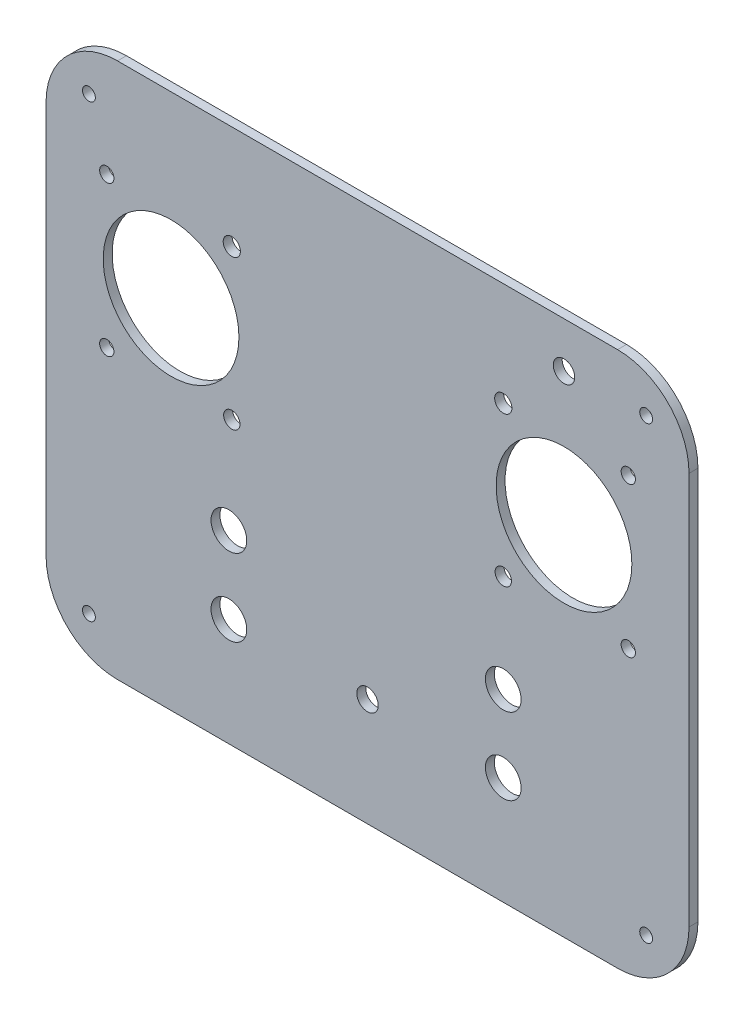
ISO-10303-21;
HEADER;
FILE_DESCRIPTION(('STEP AP214'),'2;1');
FILE_NAME('part.step','',(''),(''),'','','');
FILE_SCHEMA(('AUTOMOTIVE_DESIGN { 1 0 10303 214 1 1 1 1 }'));
ENDSEC;
DATA;
#1=APPLICATION_CONTEXT('core data for automotive mechanical design processes');
#2=APPLICATION_PROTOCOL_DEFINITION('international standard','automotive_design',2000,#1);
#3=PRODUCT_CONTEXT('',#1,'mechanical');
#4=PRODUCT('Part','Part','',(#3));
#5=PRODUCT_RELATED_PRODUCT_CATEGORY('part','',(#4));
#6=PRODUCT_DEFINITION_FORMATION('','',#4);
#7=PRODUCT_DEFINITION_CONTEXT('part definition',#1,'design');
#8=PRODUCT_DEFINITION('design','',#6,#7);
#9=PRODUCT_DEFINITION_SHAPE('','',#8);
#10=(LENGTH_UNIT() NAMED_UNIT(*) SI_UNIT(.MILLI.,.METRE.));
#11=(NAMED_UNIT(*) PLANE_ANGLE_UNIT() SI_UNIT($,.RADIAN.));
#12=(NAMED_UNIT(*) SI_UNIT($,.STERADIAN.) SOLID_ANGLE_UNIT());
#13=UNCERTAINTY_MEASURE_WITH_UNIT(LENGTH_MEASURE(1.E-05),#10,'distance_accuracy_value','');
#14=(GEOMETRIC_REPRESENTATION_CONTEXT(3) GLOBAL_UNCERTAINTY_ASSIGNED_CONTEXT((#13)) GLOBAL_UNIT_ASSIGNED_CONTEXT((#10,
#11,#12)) REPRESENTATION_CONTEXT('',''));
#15=CARTESIAN_POINT('',(0.,0.,0.));
#16=DIRECTION('',(0.,0.,1.));
#17=DIRECTION('',(1.,0.,0.));
#18=AXIS2_PLACEMENT_3D('',#15,#16,#17);
#19=CARTESIAN_POINT('',(0.,0.,2.5));
#20=DIRECTION('',(0.,0.,1.));
#21=DIRECTION('',(1.,0.,0.));
#22=AXIS2_PLACEMENT_3D('',#19,#20,#21);
#23=PLANE('',#22);
#24=CARTESIAN_POINT('',(79.0188679245283,-45.3962264150944,2.5));
#25=DIRECTION('',(0.,0.,-1.));
#26=DIRECTION('',(-1.,0.,0.));
#27=AXIS2_PLACEMENT_3D('',#24,#25,#26);
#28=CIRCLE('',#27,1.79999999999999);
#29=CARTESIAN_POINT('',(77.2188679245283,-45.3962264150944,2.5));
#30=VERTEX_POINT('',#29);
#31=EDGE_CURVE('E596',#30,#30,#28,.T.);
#32=ORIENTED_EDGE('',*,*,#31,.T.);
#33=EDGE_LOOP('',(#32));
#34=FACE_BOUND('',#33,.T.);
#35=CARTESIAN_POINT('',(79.0188679245282,80.6037735849056,2.5));
#36=DIRECTION('',(0.,0.,1.));
#37=DIRECTION('',(1.,0.,0.));
#38=AXIS2_PLACEMENT_3D('',#35,#36,#37);
#39=CIRCLE('',#38,1.79999999999999);
#40=CARTESIAN_POINT('',(80.8188679245282,80.6037735849056,2.5));
#41=VERTEX_POINT('',#40);
#42=EDGE_CURVE('E587',#41,#41,#39,.T.);
#43=ORIENTED_EDGE('',*,*,#42,.F.);
#44=EDGE_LOOP('',(#43));
#45=FACE_BOUND('',#44,.T.);
#46=CARTESIAN_POINT('',(56.0188679245283,79.8768607493267,2.5));
#47=DIRECTION('',(0.,0.,1.));
#48=DIRECTION('',(1.,0.,0.));
#49=AXIS2_PLACEMENT_3D('',#46,#47,#48);
#50=CIRCLE('',#49,3.);
#51=CARTESIAN_POINT('',(59.0188679245283,79.8768607493267,2.5));
#52=VERTEX_POINT('',#51);
#53=EDGE_CURVE('E168',#52,#52,#50,.T.);
#54=ORIENTED_EDGE('',*,*,#53,.F.);
#55=EDGE_LOOP('',(#54));
#56=FACE_BOUND('',#55,.T.);
#57=CARTESIAN_POINT('',(39.0188679245283,-27.2070166596847,2.5));
#58=DIRECTION('',(0.,0.,1.));
#59=DIRECTION('',(1.,0.,0.));
#60=AXIS2_PLACEMENT_3D('',#57,#58,#59);
#61=CIRCLE('',#60,5.);
#62=CARTESIAN_POINT('',(44.0188679245283,-27.2070166596847,2.5));
#63=VERTEX_POINT('',#62);
#64=EDGE_CURVE('E269',#63,#63,#61,.T.);
#65=ORIENTED_EDGE('',*,*,#64,.F.);
#66=EDGE_LOOP('',(#65));
#67=FACE_BOUND('',#66,.T.);
#68=CARTESIAN_POINT('',(1.01886792452827,-27.2070166596847,2.5));
#69=DIRECTION('',(0.,0.,1.));
#70=DIRECTION('',(1.,0.,0.));
#71=AXIS2_PLACEMENT_3D('',#68,#69,#70);
#72=CIRCLE('',#71,3.);
#73=CARTESIAN_POINT('',(4.01886792452827,-27.2070166596847,2.5));
#74=VERTEX_POINT('',#73);
#75=EDGE_CURVE('E265',#74,#74,#72,.T.);
#76=ORIENTED_EDGE('',*,*,#75,.F.);
#77=EDGE_LOOP('',(#76));
#78=FACE_BOUND('',#77,.T.);
#79=CARTESIAN_POINT('',(39.0188679245283,-5.76046776144588,2.5));
#80=DIRECTION('',(0.,0.,1.));
#81=DIRECTION('',(1.,0.,0.));
#82=AXIS2_PLACEMENT_3D('',#79,#80,#81);
#83=CIRCLE('',#82,5.);
#84=CARTESIAN_POINT('',(44.0188679245283,-5.76046776144588,2.5));
#85=VERTEX_POINT('',#84);
#86=EDGE_CURVE('E261',#85,#85,#83,.T.);
#87=ORIENTED_EDGE('',*,*,#86,.F.);
#88=EDGE_LOOP('',(#87));
#89=FACE_BOUND('',#88,.T.);
#90=CARTESIAN_POINT('',(-37.7979617415857,-5.63757231501688,2.5));
#91=DIRECTION('',(0.,0.,1.));
#92=DIRECTION('',(1.,0.,0.));
#93=AXIS2_PLACEMENT_3D('',#90,#91,#92);
#94=CIRCLE('',#93,5.);
#95=CARTESIAN_POINT('',(-32.7979617415857,-5.63757231501688,2.5));
#96=VERTEX_POINT('',#95);
#97=EDGE_CURVE('E257',#96,#96,#94,.T.);
#98=ORIENTED_EDGE('',*,*,#97,.F.);
#99=EDGE_LOOP('',(#98));
#100=FACE_BOUND('',#99,.T.);
#101=CARTESIAN_POINT('',(-37.7979617415857,-27.2070166596847,2.5));
#102=DIRECTION('',(0.,0.,1.));
#103=DIRECTION('',(1.,0.,0.));
#104=AXIS2_PLACEMENT_3D('',#101,#102,#103);
#105=CIRCLE('',#104,5.);
#106=CARTESIAN_POINT('',(-32.7979617415857,-27.2070166596847,2.5));
#107=VERTEX_POINT('',#106);
#108=EDGE_CURVE('E253',#107,#107,#105,.T.);
#109=ORIENTED_EDGE('',*,*,#108,.F.);
#110=EDGE_LOOP('',(#109));
#111=FACE_BOUND('',#110,.T.);
#112=CARTESIAN_POINT('',(39.0188679245283,21.6037735849056,2.5));
#113=DIRECTION('',(0.,0.,1.));
#114=DIRECTION('',(1.,0.,0.));
#115=AXIS2_PLACEMENT_3D('',#112,#113,#114);
#116=CIRCLE('',#115,2.29012975988847);
#117=CARTESIAN_POINT('',(41.3089976844167,21.6037735849056,2.5));
#118=VERTEX_POINT('',#117);
#119=EDGE_CURVE('E249',#118,#118,#116,.F.);
#120=ORIENTED_EDGE('',*,*,#119,.T.);
#121=EDGE_LOOP('',(#120));
#122=FACE_BOUND('',#121,.T.);
#123=CARTESIAN_POINT('',(74.0188679245283,21.6037735849056,2.5));
#124=DIRECTION('',(0.,0.,1.));
#125=DIRECTION('',(1.,0.,0.));
#126=AXIS2_PLACEMENT_3D('',#123,#124,#125);
#127=CIRCLE('',#126,2.);
#128=CARTESIAN_POINT('',(76.0188679245283,21.6037735849056,2.5));
#129=VERTEX_POINT('',#128);
#130=EDGE_CURVE('E245',#129,#129,#127,.T.);
#131=ORIENTED_EDGE('',*,*,#130,.F.);
#132=EDGE_LOOP('',(#131));
#133=FACE_BOUND('',#132,.T.);
#134=CARTESIAN_POINT('',(39.0188679245283,63.6037735849056,2.5));
#135=DIRECTION('',(0.,0.,1.));
#136=DIRECTION('',(1.,0.,0.));
#137=AXIS2_PLACEMENT_3D('',#134,#135,#136);
#138=CIRCLE('',#137,2.41222754524556);
#139=CARTESIAN_POINT('',(41.4310954697738,63.6037735849056,2.5));
#140=VERTEX_POINT('',#139);
#141=EDGE_CURVE('E241',#140,#140,#138,.F.);
#142=ORIENTED_EDGE('',*,*,#141,.T.);
#143=EDGE_LOOP('',(#142));
#144=FACE_BOUND('',#143,.T.);
#145=CARTESIAN_POINT('',(-36.9811320754717,21.6037735849056,2.5));
#146=DIRECTION('',(0.,0.,1.));
#147=DIRECTION('',(1.,0.,0.));
#148=AXIS2_PLACEMENT_3D('',#145,#146,#147);
#149=CIRCLE('',#148,2.29012975988847);
#150=CARTESIAN_POINT('',(-34.6910023155833,21.6037735849056,2.5));
#151=VERTEX_POINT('',#150);
#152=EDGE_CURVE('E237',#151,#151,#149,.T.);
#153=ORIENTED_EDGE('',*,*,#152,.F.);
#154=EDGE_LOOP('',(#153));
#155=FACE_BOUND('',#154,.T.);
#156=CARTESIAN_POINT('',(-36.9811320754717,63.6037735849056,2.5));
#157=DIRECTION('',(0.,0.,1.));
#158=DIRECTION('',(1.,0.,0.));
#159=AXIS2_PLACEMENT_3D('',#156,#157,#158);
#160=CIRCLE('',#159,2.41222754524556);
#161=CARTESIAN_POINT('',(-34.5689045302262,63.6037735849056,2.5));
#162=VERTEX_POINT('',#161);
#163=EDGE_CURVE('E233',#162,#162,#160,.T.);
#164=ORIENTED_EDGE('',*,*,#163,.F.);
#165=EDGE_LOOP('',(#164));
#166=FACE_BOUND('',#165,.T.);
#167=DIRECTION('',(1.,0.,0.));
#168=VECTOR('',#167,1.);
#169=CARTESIAN_POINT('',(0.,92.6037735849056,2.5));
#170=LINE('',#169,#168);
#171=CARTESIAN_POINT('',(-68.9811320754717,92.6037735849056,2.5));
#172=VERTEX_POINT('',#171);
#173=CARTESIAN_POINT('',(71.0188679245283,92.6037735849056,2.5));
#174=VERTEX_POINT('',#173);
#175=EDGE_CURVE('E225',#172,#174,#170,.T.);
#176=ORIENTED_EDGE('',*,*,#175,.F.);
#177=CARTESIAN_POINT('',(-68.9811320754717,72.6037735849056,2.5));
#178=DIRECTION('',(0.,0.,1.));
#179=DIRECTION('',(1.,0.,0.));
#180=AXIS2_PLACEMENT_3D('',#177,#178,#179);
#181=CIRCLE('',#180,20.);
#182=CARTESIAN_POINT('',(-88.9811320754717,72.6037735849056,2.5));
#183=VERTEX_POINT('',#182);
#184=EDGE_CURVE('E191',#172,#183,#181,.T.);
#185=ORIENTED_EDGE('',*,*,#184,.T.);
#186=DIRECTION('',(0.,-1.,0.));
#187=VECTOR('',#186,1.);
#188=CARTESIAN_POINT('',(-88.9811320754717,0.,2.5));
#189=LINE('',#188,#187);
#190=CARTESIAN_POINT('',(-88.9811320754717,-37.3962264150944,2.5));
#191=VERTEX_POINT('',#190);
#192=EDGE_CURVE('E128',#183,#191,#189,.T.);
#193=ORIENTED_EDGE('',*,*,#192,.T.);
#194=CARTESIAN_POINT('',(-68.9811320754717,-37.3962264150944,2.5));
#195=DIRECTION('',(0.,0.,1.));
#196=DIRECTION('',(1.,0.,0.));
#197=AXIS2_PLACEMENT_3D('',#194,#195,#196);
#198=CIRCLE('',#197,20.);
#199=CARTESIAN_POINT('',(-68.9811320754717,-57.3962264150944,2.5));
#200=VERTEX_POINT('',#199);
#201=EDGE_CURVE('E63',#191,#200,#198,.T.);
#202=ORIENTED_EDGE('',*,*,#201,.T.);
#203=DIRECTION('',(1.,0.,0.));
#204=VECTOR('',#203,1.);
#205=CARTESIAN_POINT('',(0.,-57.3962264150944,2.5));
#206=LINE('',#205,#204);
#207=CARTESIAN_POINT('',(71.0188679245283,-57.3962264150944,2.5));
#208=VERTEX_POINT('',#207);
#209=EDGE_CURVE('E220',#200,#208,#206,.T.);
#210=ORIENTED_EDGE('',*,*,#209,.T.);
#211=CARTESIAN_POINT('',(71.0188679245283,-37.3962264150944,2.5));
#212=DIRECTION('',(0.,0.,1.));
#213=DIRECTION('',(1.,0.,0.));
#214=AXIS2_PLACEMENT_3D('',#211,#212,#213);
#215=CIRCLE('',#214,20.);
#216=CARTESIAN_POINT('',(91.0188679245283,-37.3962264150944,2.5));
#217=VERTEX_POINT('',#216);
#218=EDGE_CURVE('E183',#208,#217,#215,.T.);
#219=ORIENTED_EDGE('',*,*,#218,.T.);
#220=DIRECTION('',(0.,-1.,0.));
#221=VECTOR('',#220,1.);
#222=CARTESIAN_POINT('',(91.0188679245283,0.,2.5));
#223=LINE('',#222,#221);
#224=CARTESIAN_POINT('',(91.0188679245283,72.6037735849056,2.5));
#225=VERTEX_POINT('',#224);
#226=EDGE_CURVE('E229',#225,#217,#223,.T.);
#227=ORIENTED_EDGE('',*,*,#226,.F.);
#228=CARTESIAN_POINT('',(71.0188679245283,72.6037735849056,2.5));
#229=DIRECTION('',(0.,0.,1.));
#230=DIRECTION('',(1.,0.,0.));
#231=AXIS2_PLACEMENT_3D('',#228,#229,#230);
#232=CIRCLE('',#231,20.);
#233=EDGE_CURVE('E188',#225,#174,#232,.T.);
#234=ORIENTED_EDGE('',*,*,#233,.T.);
#235=EDGE_LOOP('',(#176,#185,#193,#202,#210,#219,#227,#234));
#236=FACE_BOUND('',#235,.T.);
#237=CARTESIAN_POINT('',(-53.9811320754717,42.6037735849056,2.5));
#238=DIRECTION('',(0.,0.,1.));
#239=DIRECTION('',(1.,0.,0.));
#240=AXIS2_PLACEMENT_3D('',#237,#238,#239);
#241=CIRCLE('',#240,19.);
#242=CARTESIAN_POINT('',(-34.9811320754717,42.6037735849056,2.5));
#243=VERTEX_POINT('',#242);
#244=EDGE_CURVE('E216',#243,#243,#241,.T.);
#245=ORIENTED_EDGE('',*,*,#244,.F.);
#246=EDGE_LOOP('',(#245));
#247=FACE_BOUND('',#246,.T.);
#248=CARTESIAN_POINT('',(-71.9811320754717,63.6037735849056,2.5));
#249=DIRECTION('',(0.,0.,1.));
#250=DIRECTION('',(1.,0.,0.));
#251=AXIS2_PLACEMENT_3D('',#248,#249,#250);
#252=CIRCLE('',#251,2.);
#253=CARTESIAN_POINT('',(-69.9811320754717,63.6037735849056,2.5));
#254=VERTEX_POINT('',#253);
#255=EDGE_CURVE('E212',#254,#254,#252,.T.);
#256=ORIENTED_EDGE('',*,*,#255,.F.);
#257=EDGE_LOOP('',(#256));
#258=FACE_BOUND('',#257,.T.);
#259=CARTESIAN_POINT('',(-71.9811320754717,21.6037735849056,2.5));
#260=DIRECTION('',(0.,0.,1.));
#261=DIRECTION('',(1.,0.,0.));
#262=AXIS2_PLACEMENT_3D('',#259,#260,#261);
#263=CIRCLE('',#262,2.);
#264=CARTESIAN_POINT('',(-69.9811320754717,21.6037735849056,2.5));
#265=VERTEX_POINT('',#264);
#266=EDGE_CURVE('E208',#265,#265,#263,.F.);
#267=ORIENTED_EDGE('',*,*,#266,.T.);
#268=EDGE_LOOP('',(#267));
#269=FACE_BOUND('',#268,.T.);
#270=CARTESIAN_POINT('',(74.0188679245283,63.6037735849056,2.5));
#271=DIRECTION('',(0.,0.,1.));
#272=DIRECTION('',(1.,0.,0.));
#273=AXIS2_PLACEMENT_3D('',#270,#271,#272);
#274=CIRCLE('',#273,2.);
#275=CARTESIAN_POINT('',(76.0188679245283,63.6037735849056,2.5));
#276=VERTEX_POINT('',#275);
#277=EDGE_CURVE('E204',#276,#276,#274,.F.);
#278=ORIENTED_EDGE('',*,*,#277,.T.);
#279=EDGE_LOOP('',(#278));
#280=FACE_BOUND('',#279,.T.);
#281=CARTESIAN_POINT('',(56.0188679245283,42.6037735849056,2.5));
#282=DIRECTION('',(0.,0.,1.));
#283=DIRECTION('',(1.,0.,0.));
#284=AXIS2_PLACEMENT_3D('',#281,#282,#283);
#285=CIRCLE('',#284,19.);
#286=CARTESIAN_POINT('',(75.0188679245283,42.6037735849056,2.5));
#287=VERTEX_POINT('',#286);
#288=EDGE_CURVE('E170',#287,#287,#285,.F.);
#289=ORIENTED_EDGE('',*,*,#288,.T.);
#290=EDGE_LOOP('',(#289));
#291=FACE_BOUND('',#290,.T.);
#292=CARTESIAN_POINT('',(-76.9811320754717,-45.3962264150944,2.5));
#293=DIRECTION('',(0.,0.,1.));
#294=DIRECTION('',(1.,0.,0.));
#295=AXIS2_PLACEMENT_3D('',#292,#293,#294);
#296=CIRCLE('',#295,1.79999999999999);
#297=CARTESIAN_POINT('',(-75.1811320754717,-45.3962264150944,2.5));
#298=VERTEX_POINT('',#297);
#299=EDGE_CURVE('E583',#298,#298,#296,.T.);
#300=ORIENTED_EDGE('',*,*,#299,.F.);
#301=EDGE_LOOP('',(#300));
#302=FACE_BOUND('',#301,.T.);
#303=CARTESIAN_POINT('',(-76.9811320754717,80.6037735849056,2.5));
#304=DIRECTION('',(0.,0.,-1.));
#305=DIRECTION('',(-1.,0.,0.));
#306=AXIS2_PLACEMENT_3D('',#303,#304,#305);
#307=CIRCLE('',#306,1.80000000000001);
#308=CARTESIAN_POINT('',(-78.7811320754717,80.6037735849056,2.5));
#309=VERTEX_POINT('',#308);
#310=EDGE_CURVE('E572',#309,#309,#307,.T.);
#311=ORIENTED_EDGE('',*,*,#310,.T.);
#312=EDGE_LOOP('',(#311));
#313=FACE_BOUND('',#312,.T.);
#314=ADVANCED_FACE('F41',(#34,#45,#56,#67,#78,#89,#100,#111,#122,#133,#144,#155,#166,#236,#247,
#258,#269,#280,#291,#302,#313),#23,.T.);
#315=CARTESIAN_POINT('',(0.,0.,0.));
#316=DIRECTION('',(0.,0.,1.));
#317=DIRECTION('',(1.,0.,0.));
#318=AXIS2_PLACEMENT_3D('',#315,#316,#317);
#319=PLANE('',#318);
#320=CARTESIAN_POINT('',(-76.9811320754717,-45.3962264150944,0.));
#321=DIRECTION('',(0.,0.,1.));
#322=DIRECTION('',(1.,0.,0.));
#323=AXIS2_PLACEMENT_3D('',#320,#321,#322);
#324=CIRCLE('',#323,1.79999999999999);
#325=CARTESIAN_POINT('',(-75.1811320754717,-45.3962264150944,0.));
#326=VERTEX_POINT('',#325);
#327=EDGE_CURVE('E578',#326,#326,#324,.F.);
#328=ORIENTED_EDGE('',*,*,#327,.F.);
#329=EDGE_LOOP('',(#328));
#330=FACE_BOUND('',#329,.T.);
#331=CARTESIAN_POINT('',(79.0188679245282,80.6037735849056,0.));
#332=DIRECTION('',(0.,0.,1.));
#333=DIRECTION('',(1.,0.,0.));
#334=AXIS2_PLACEMENT_3D('',#331,#332,#333);
#335=CIRCLE('',#334,1.79999999999999);
#336=CARTESIAN_POINT('',(80.8188679245282,80.6037735849056,0.));
#337=VERTEX_POINT('',#336);
#338=EDGE_CURVE('E279',#337,#337,#335,.F.);
#339=ORIENTED_EDGE('',*,*,#338,.F.);
#340=EDGE_LOOP('',(#339));
#341=FACE_BOUND('',#340,.T.);
#342=CARTESIAN_POINT('',(56.0188679245283,79.8768607493267,0.));
#343=DIRECTION('',(0.,0.,1.));
#344=DIRECTION('',(1.,0.,0.));
#345=AXIS2_PLACEMENT_3D('',#342,#343,#344);
#346=CIRCLE('',#345,3.);
#347=CARTESIAN_POINT('',(59.0188679245283,79.8768607493267,0.));
#348=VERTEX_POINT('',#347);
#349=EDGE_CURVE('E282',#348,#348,#346,.T.);
#350=ORIENTED_EDGE('',*,*,#349,.T.);
#351=EDGE_LOOP('',(#350));
#352=FACE_BOUND('',#351,.T.);
#353=CARTESIAN_POINT('',(39.0188679245283,-27.2070166596847,0.));
#354=DIRECTION('',(0.,0.,1.));
#355=DIRECTION('',(1.,0.,0.));
#356=AXIS2_PLACEMENT_3D('',#353,#354,#355);
#357=CIRCLE('',#356,5.);
#358=CARTESIAN_POINT('',(44.0188679245283,-27.2070166596847,0.));
#359=VERTEX_POINT('',#358);
#360=EDGE_CURVE('E286',#359,#359,#357,.T.);
#361=ORIENTED_EDGE('',*,*,#360,.T.);
#362=EDGE_LOOP('',(#361));
#363=FACE_BOUND('',#362,.T.);
#364=CARTESIAN_POINT('',(1.01886792452827,-27.2070166596847,0.));
#365=DIRECTION('',(0.,0.,1.));
#366=DIRECTION('',(1.,0.,0.));
#367=AXIS2_PLACEMENT_3D('',#364,#365,#366);
#368=CIRCLE('',#367,3.);
#369=CARTESIAN_POINT('',(4.01886792452827,-27.2070166596847,0.));
#370=VERTEX_POINT('',#369);
#371=EDGE_CURVE('E290',#370,#370,#368,.T.);
#372=ORIENTED_EDGE('',*,*,#371,.T.);
#373=EDGE_LOOP('',(#372));
#374=FACE_BOUND('',#373,.T.);
#375=CARTESIAN_POINT('',(39.0188679245283,-5.76046776144588,0.));
#376=DIRECTION('',(0.,0.,1.));
#377=DIRECTION('',(1.,0.,0.));
#378=AXIS2_PLACEMENT_3D('',#375,#376,#377);
#379=CIRCLE('',#378,5.);
#380=CARTESIAN_POINT('',(44.0188679245283,-5.76046776144588,0.));
#381=VERTEX_POINT('',#380);
#382=EDGE_CURVE('E294',#381,#381,#379,.T.);
#383=ORIENTED_EDGE('',*,*,#382,.T.);
#384=EDGE_LOOP('',(#383));
#385=FACE_BOUND('',#384,.T.);
#386=CARTESIAN_POINT('',(-37.7979617415857,-5.63757231501688,0.));
#387=DIRECTION('',(0.,0.,1.));
#388=DIRECTION('',(1.,0.,0.));
#389=AXIS2_PLACEMENT_3D('',#386,#387,#388);
#390=CIRCLE('',#389,5.);
#391=CARTESIAN_POINT('',(-32.7979617415857,-5.63757231501688,0.));
#392=VERTEX_POINT('',#391);
#393=EDGE_CURVE('E298',#392,#392,#390,.T.);
#394=ORIENTED_EDGE('',*,*,#393,.T.);
#395=EDGE_LOOP('',(#394));
#396=FACE_BOUND('',#395,.T.);
#397=CARTESIAN_POINT('',(-37.7979617415857,-27.2070166596847,0.));
#398=DIRECTION('',(0.,0.,1.));
#399=DIRECTION('',(1.,0.,0.));
#400=AXIS2_PLACEMENT_3D('',#397,#398,#399);
#401=CIRCLE('',#400,5.);
#402=CARTESIAN_POINT('',(-32.7979617415857,-27.2070166596847,0.));
#403=VERTEX_POINT('',#402);
#404=EDGE_CURVE('E302',#403,#403,#401,.T.);
#405=ORIENTED_EDGE('',*,*,#404,.T.);
#406=EDGE_LOOP('',(#405));
#407=FACE_BOUND('',#406,.T.);
#408=CARTESIAN_POINT('',(39.0188679245283,21.6037735849056,0.));
#409=DIRECTION('',(0.,0.,1.));
#410=DIRECTION('',(1.,0.,0.));
#411=AXIS2_PLACEMENT_3D('',#408,#409,#410);
#412=CIRCLE('',#411,2.29012975988847);
#413=CARTESIAN_POINT('',(41.3089976844167,21.6037735849056,0.));
#414=VERTEX_POINT('',#413);
#415=EDGE_CURVE('E306',#414,#414,#412,.F.);
#416=ORIENTED_EDGE('',*,*,#415,.F.);
#417=EDGE_LOOP('',(#416));
#418=FACE_BOUND('',#417,.T.);
#419=CARTESIAN_POINT('',(74.0188679245283,21.6037735849056,0.));
#420=DIRECTION('',(0.,0.,1.));
#421=DIRECTION('',(1.,0.,0.));
#422=AXIS2_PLACEMENT_3D('',#419,#420,#421);
#423=CIRCLE('',#422,2.);
#424=CARTESIAN_POINT('',(76.0188679245283,21.6037735849056,0.));
#425=VERTEX_POINT('',#424);
#426=EDGE_CURVE('E310',#425,#425,#423,.T.);
#427=ORIENTED_EDGE('',*,*,#426,.T.);
#428=EDGE_LOOP('',(#427));
#429=FACE_BOUND('',#428,.T.);
#430=CARTESIAN_POINT('',(39.0188679245283,63.6037735849056,0.));
#431=DIRECTION('',(0.,0.,1.));
#432=DIRECTION('',(1.,0.,0.));
#433=AXIS2_PLACEMENT_3D('',#430,#431,#432);
#434=CIRCLE('',#433,2.41222754524556);
#435=CARTESIAN_POINT('',(41.4310954697738,63.6037735849056,0.));
#436=VERTEX_POINT('',#435);
#437=EDGE_CURVE('E314',#436,#436,#434,.F.);
#438=ORIENTED_EDGE('',*,*,#437,.F.);
#439=EDGE_LOOP('',(#438));
#440=FACE_BOUND('',#439,.T.);
#441=CARTESIAN_POINT('',(-36.9811320754717,21.6037735849056,0.));
#442=DIRECTION('',(0.,0.,1.));
#443=DIRECTION('',(1.,0.,0.));
#444=AXIS2_PLACEMENT_3D('',#441,#442,#443);
#445=CIRCLE('',#444,2.29012975988847);
#446=CARTESIAN_POINT('',(-34.6910023155833,21.6037735849056,0.));
#447=VERTEX_POINT('',#446);
#448=EDGE_CURVE('E318',#447,#447,#445,.T.);
#449=ORIENTED_EDGE('',*,*,#448,.T.);
#450=EDGE_LOOP('',(#449));
#451=FACE_BOUND('',#450,.T.);
#452=CARTESIAN_POINT('',(-36.9811320754717,63.6037735849056,0.));
#453=DIRECTION('',(0.,0.,1.));
#454=DIRECTION('',(1.,0.,0.));
#455=AXIS2_PLACEMENT_3D('',#452,#453,#454);
#456=CIRCLE('',#455,2.41222754524556);
#457=CARTESIAN_POINT('',(-34.5689045302262,63.6037735849056,0.));
#458=VERTEX_POINT('',#457);
#459=EDGE_CURVE('E322',#458,#458,#456,.T.);
#460=ORIENTED_EDGE('',*,*,#459,.T.);
#461=EDGE_LOOP('',(#460));
#462=FACE_BOUND('',#461,.T.);
#463=DIRECTION('',(0.,-1.,0.));
#464=VECTOR('',#463,1.);
#465=CARTESIAN_POINT('',(-88.9811320754717,0.,0.));
#466=LINE('',#465,#464);
#467=CARTESIAN_POINT('',(-88.9811320754717,72.6037735849056,0.));
#468=VERTEX_POINT('',#467);
#469=CARTESIAN_POINT('',(-88.9811320754717,-37.3962264150944,0.));
#470=VERTEX_POINT('',#469);
#471=EDGE_CURVE('E126',#468,#470,#466,.T.);
#472=ORIENTED_EDGE('',*,*,#471,.F.);
#473=CARTESIAN_POINT('',(-68.9811320754717,72.6037735849056,0.));
#474=DIRECTION('',(0.,0.,1.));
#475=DIRECTION('',(1.,0.,0.));
#476=AXIS2_PLACEMENT_3D('',#473,#474,#475);
#477=CIRCLE('',#476,20.);
#478=CARTESIAN_POINT('',(-68.9811320754717,92.6037735849056,0.));
#479=VERTEX_POINT('',#478);
#480=EDGE_CURVE('E108',#468,#479,#477,.F.);
#481=ORIENTED_EDGE('',*,*,#480,.T.);
#482=DIRECTION('',(1.,0.,0.));
#483=VECTOR('',#482,1.);
#484=CARTESIAN_POINT('',(0.,92.6037735849056,0.));
#485=LINE('',#484,#483);
#486=CARTESIAN_POINT('',(71.0188679245283,92.6037735849056,0.));
#487=VERTEX_POINT('',#486);
#488=EDGE_CURVE('E139',#479,#487,#485,.T.);
#489=ORIENTED_EDGE('',*,*,#488,.T.);
#490=CARTESIAN_POINT('',(71.0188679245283,72.6037735849056,0.));
#491=DIRECTION('',(0.,0.,1.));
#492=DIRECTION('',(1.,0.,0.));
#493=AXIS2_PLACEMENT_3D('',#490,#491,#492);
#494=CIRCLE('',#493,20.);
#495=CARTESIAN_POINT('',(91.0188679245283,72.6037735849056,0.));
#496=VERTEX_POINT('',#495);
#497=EDGE_CURVE('E120',#487,#496,#494,.F.);
#498=ORIENTED_EDGE('',*,*,#497,.T.);
#499=DIRECTION('',(0.,-1.,0.));
#500=VECTOR('',#499,1.);
#501=CARTESIAN_POINT('',(91.0188679245283,0.,0.));
#502=LINE('',#501,#500);
#503=CARTESIAN_POINT('',(91.0188679245283,-37.3962264150944,0.));
#504=VERTEX_POINT('',#503);
#505=EDGE_CURVE('E145',#496,#504,#502,.T.);
#506=ORIENTED_EDGE('',*,*,#505,.T.);
#507=CARTESIAN_POINT('',(71.0188679245283,-37.3962264150944,0.));
#508=DIRECTION('',(0.,0.,1.));
#509=DIRECTION('',(1.,0.,0.));
#510=AXIS2_PLACEMENT_3D('',#507,#508,#509);
#511=CIRCLE('',#510,20.);
#512=CARTESIAN_POINT('',(71.0188679245283,-57.3962264150944,0.));
#513=VERTEX_POINT('',#512);
#514=EDGE_CURVE('E130',#504,#513,#511,.F.);
#515=ORIENTED_EDGE('',*,*,#514,.T.);
#516=DIRECTION('',(1.,0.,0.));
#517=VECTOR('',#516,1.);
#518=CARTESIAN_POINT('',(0.,-57.3962264150944,0.));
#519=LINE('',#518,#517);
#520=CARTESIAN_POINT('',(-68.9811320754717,-57.3962264150944,0.));
#521=VERTEX_POINT('',#520);
#522=EDGE_CURVE('E138',#521,#513,#519,.T.);
#523=ORIENTED_EDGE('',*,*,#522,.F.);
#524=CARTESIAN_POINT('',(-68.9811320754717,-37.3962264150944,0.));
#525=DIRECTION('',(0.,0.,1.));
#526=DIRECTION('',(1.,0.,0.));
#527=AXIS2_PLACEMENT_3D('',#524,#525,#526);
#528=CIRCLE('',#527,20.);
#529=EDGE_CURVE('E136',#521,#470,#528,.F.);
#530=ORIENTED_EDGE('',*,*,#529,.T.);
#531=EDGE_LOOP('',(#472,#481,#489,#498,#506,#515,#523,#530));
#532=FACE_BOUND('',#531,.T.);
#533=CARTESIAN_POINT('',(-53.9811320754717,42.6037735849056,0.));
#534=DIRECTION('',(0.,0.,1.));
#535=DIRECTION('',(1.,0.,0.));
#536=AXIS2_PLACEMENT_3D('',#533,#534,#535);
#537=CIRCLE('',#536,19.);
#538=CARTESIAN_POINT('',(-34.9811320754717,42.6037735849056,0.));
#539=VERTEX_POINT('',#538);
#540=EDGE_CURVE('E143',#539,#539,#537,.T.);
#541=ORIENTED_EDGE('',*,*,#540,.T.);
#542=EDGE_LOOP('',(#541));
#543=FACE_BOUND('',#542,.T.);
#544=CARTESIAN_POINT('',(-71.9811320754717,63.6037735849056,0.));
#545=DIRECTION('',(0.,0.,1.));
#546=DIRECTION('',(1.,0.,0.));
#547=AXIS2_PLACEMENT_3D('',#544,#545,#546);
#548=CIRCLE('',#547,2.);
#549=CARTESIAN_POINT('',(-69.9811320754717,63.6037735849056,0.));
#550=VERTEX_POINT('',#549);
#551=EDGE_CURVE('E152',#550,#550,#548,.T.);
#552=ORIENTED_EDGE('',*,*,#551,.T.);
#553=EDGE_LOOP('',(#552));
#554=FACE_BOUND('',#553,.T.);
#555=CARTESIAN_POINT('',(-71.9811320754717,21.6037735849056,0.));
#556=DIRECTION('',(0.,0.,1.));
#557=DIRECTION('',(1.,0.,0.));
#558=AXIS2_PLACEMENT_3D('',#555,#556,#557);
#559=CIRCLE('',#558,2.);
#560=CARTESIAN_POINT('',(-69.9811320754717,21.6037735849056,0.));
#561=VERTEX_POINT('',#560);
#562=EDGE_CURVE('E156',#561,#561,#559,.F.);
#563=ORIENTED_EDGE('',*,*,#562,.F.);
#564=EDGE_LOOP('',(#563));
#565=FACE_BOUND('',#564,.T.);
#566=CARTESIAN_POINT('',(74.0188679245283,63.6037735849056,0.));
#567=DIRECTION('',(0.,0.,1.));
#568=DIRECTION('',(1.,0.,0.));
#569=AXIS2_PLACEMENT_3D('',#566,#567,#568);
#570=CIRCLE('',#569,2.);
#571=CARTESIAN_POINT('',(76.0188679245283,63.6037735849056,0.));
#572=VERTEX_POINT('',#571);
#573=EDGE_CURVE('E160',#572,#572,#570,.F.);
#574=ORIENTED_EDGE('',*,*,#573,.F.);
#575=EDGE_LOOP('',(#574));
#576=FACE_BOUND('',#575,.T.);
#577=CARTESIAN_POINT('',(56.0188679245283,42.6037735849056,0.));
#578=DIRECTION('',(0.,0.,1.));
#579=DIRECTION('',(1.,0.,0.));
#580=AXIS2_PLACEMENT_3D('',#577,#578,#579);
#581=CIRCLE('',#580,19.);
#582=CARTESIAN_POINT('',(75.0188679245283,42.6037735849056,0.));
#583=VERTEX_POINT('',#582);
#584=EDGE_CURVE('E164',#583,#583,#581,.F.);
#585=ORIENTED_EDGE('',*,*,#584,.F.);
#586=EDGE_LOOP('',(#585));
#587=FACE_BOUND('',#586,.T.);
#588=CARTESIAN_POINT('',(79.0188679245283,-45.3962264150944,0.));
#589=DIRECTION('',(0.,0.,1.));
#590=DIRECTION('',(1.,0.,0.));
#591=AXIS2_PLACEMENT_3D('',#588,#589,#590);
#592=CIRCLE('',#591,1.79999999999999);
#593=CARTESIAN_POINT('',(80.8188679245283,-45.3962264150944,0.));
#594=VERTEX_POINT('',#593);
#595=EDGE_CURVE('E590',#594,#594,#592,.T.);
#596=ORIENTED_EDGE('',*,*,#595,.T.);
#597=EDGE_LOOP('',(#596));
#598=FACE_BOUND('',#597,.T.);
#599=CARTESIAN_POINT('',(-76.9811320754717,80.6037735849056,0.));
#600=DIRECTION('',(0.,0.,1.));
#601=DIRECTION('',(1.,0.,0.));
#602=AXIS2_PLACEMENT_3D('',#599,#600,#601);
#603=CIRCLE('',#602,1.80000000000001);
#604=CARTESIAN_POINT('',(-75.1811320754717,80.6037735849056,0.));
#605=VERTEX_POINT('',#604);
#606=EDGE_CURVE('E575',#605,#605,#603,.T.);
#607=ORIENTED_EDGE('',*,*,#606,.T.);
#608=EDGE_LOOP('',(#607));
#609=FACE_BOUND('',#608,.T.);
#610=ADVANCED_FACE('F133',(#330,#341,#352,#363,#374,#385,#396,#407,#418,#429,#440,#451,#462,
#532,#543,#554,#565,#576,#587,#598,#609),#319,.F.);
#611=CARTESIAN_POINT('',(91.0188679245283,0.,2.5));
#612=DIRECTION('',(1.,0.,0.));
#613=DIRECTION('',(0.,1.,0.));
#614=AXIS2_PLACEMENT_3D('',#611,#612,#613);
#615=PLANE('',#614);
#616=ORIENTED_EDGE('',*,*,#505,.F.);
#617=DIRECTION('',(0.,0.,-1.));
#618=VECTOR('',#617,1.);
#619=CARTESIAN_POINT('',(91.0188679245283,72.6037735849056,2.5));
#620=LINE('',#619,#618);
#621=EDGE_CURVE('E198',#496,#225,#620,.F.);
#622=ORIENTED_EDGE('',*,*,#621,.T.);
#623=ORIENTED_EDGE('',*,*,#226,.T.);
#624=DIRECTION('',(0.,0.,-1.));
#625=VECTOR('',#624,1.);
#626=CARTESIAN_POINT('',(91.0188679245283,-37.3962264150944,0.));
#627=LINE('',#626,#625);
#628=EDGE_CURVE('E194',#217,#504,#627,.T.);
#629=ORIENTED_EDGE('',*,*,#628,.T.);
#630=EDGE_LOOP('',(#616,#622,#623,#629));
#631=FACE_BOUND('',#630,.T.);
#632=ADVANCED_FACE('F330',(#631),#615,.T.);
#633=CARTESIAN_POINT('',(0.,92.6037735849056,2.5));
#634=DIRECTION('',(0.,1.,0.));
#635=DIRECTION('',(0.,0.,1.));
#636=AXIS2_PLACEMENT_3D('',#633,#634,#635);
#637=PLANE('',#636);
#638=ORIENTED_EDGE('',*,*,#488,.F.);
#639=DIRECTION('',(0.,0.,-1.));
#640=VECTOR('',#639,1.);
#641=CARTESIAN_POINT('',(-68.9811320754717,92.6037735849056,2.5));
#642=LINE('',#641,#640);
#643=EDGE_CURVE('E113',#479,#172,#642,.F.);
#644=ORIENTED_EDGE('',*,*,#643,.T.);
#645=ORIENTED_EDGE('',*,*,#175,.T.);
#646=DIRECTION('',(0.,0.,-1.));
#647=VECTOR('',#646,1.);
#648=CARTESIAN_POINT('',(71.0188679245283,92.6037735849056,2.5));
#649=LINE('',#648,#647);
#650=EDGE_CURVE('E119',#174,#487,#649,.T.);
#651=ORIENTED_EDGE('',*,*,#650,.T.);
#652=EDGE_LOOP('',(#638,#644,#645,#651));
#653=FACE_BOUND('',#652,.T.);
#654=ADVANCED_FACE('F340',(#653),#637,.T.);
#655=CARTESIAN_POINT('',(-88.9811320754717,0.,2.5));
#656=DIRECTION('',(1.,0.,0.));
#657=DIRECTION('',(0.,0.,-1.));
#658=AXIS2_PLACEMENT_3D('',#655,#656,#657);
#659=PLANE('',#658);
#660=ORIENTED_EDGE('',*,*,#192,.F.);
#661=DIRECTION('',(0.,0.,-1.));
#662=VECTOR('',#661,1.);
#663=CARTESIAN_POINT('',(-88.9811320754717,72.6037735849056,0.));
#664=LINE('',#663,#662);
#665=EDGE_CURVE('E112',#183,#468,#664,.T.);
#666=ORIENTED_EDGE('',*,*,#665,.T.);
#667=ORIENTED_EDGE('',*,*,#471,.T.);
#668=DIRECTION('',(0.,0.,-1.));
#669=VECTOR('',#668,1.);
#670=CARTESIAN_POINT('',(-88.9811320754717,-37.3962264150944,2.5));
#671=LINE('',#670,#669);
#672=EDGE_CURVE('E131',#470,#191,#671,.F.);
#673=ORIENTED_EDGE('',*,*,#672,.T.);
#674=EDGE_LOOP('',(#660,#666,#667,#673));
#675=FACE_BOUND('',#674,.T.);
#676=ADVANCED_FACE('F125',(#675),#659,.F.);
#677=CARTESIAN_POINT('',(74.0188679245283,63.6037735849056,2.5));
#678=DIRECTION('',(0.,0.,-1.));
#679=DIRECTION('',(-1.,0.,0.));
#680=AXIS2_PLACEMENT_3D('',#677,#678,#679);
#681=CYLINDRICAL_SURFACE('',#680,2.);
#682=ORIENTED_EDGE('',*,*,#277,.F.);
#683=EDGE_LOOP('',(#682));
#684=FACE_BOUND('',#683,.T.);
#685=ORIENTED_EDGE('',*,*,#573,.T.);
#686=EDGE_LOOP('',(#685));
#687=FACE_BOUND('',#686,.T.);
#688=ADVANCED_FACE('F347',(#684,#687),#681,.F.);
#689=CARTESIAN_POINT('',(-71.9811320754717,21.6037735849056,2.5));
#690=DIRECTION('',(0.,0.,-1.));
#691=DIRECTION('',(-1.,0.,0.));
#692=AXIS2_PLACEMENT_3D('',#689,#690,#691);
#693=CYLINDRICAL_SURFACE('',#692,2.);
#694=ORIENTED_EDGE('',*,*,#266,.F.);
#695=EDGE_LOOP('',(#694));
#696=FACE_BOUND('',#695,.T.);
#697=ORIENTED_EDGE('',*,*,#562,.T.);
#698=EDGE_LOOP('',(#697));
#699=FACE_BOUND('',#698,.T.);
#700=ADVANCED_FACE('F371',(#696,#699),#693,.F.);
#701=CARTESIAN_POINT('',(-71.9811320754717,63.6037735849056,2.5));
#702=DIRECTION('',(0.,0.,-1.));
#703=DIRECTION('',(-1.,0.,0.));
#704=AXIS2_PLACEMENT_3D('',#701,#702,#703);
#705=CYLINDRICAL_SURFACE('',#704,2.);
#706=ORIENTED_EDGE('',*,*,#255,.T.);
#707=EDGE_LOOP('',(#706));
#708=FACE_BOUND('',#707,.T.);
#709=ORIENTED_EDGE('',*,*,#551,.F.);
#710=EDGE_LOOP('',(#709));
#711=FACE_BOUND('',#710,.T.);
#712=ADVANCED_FACE('F375',(#708,#711),#705,.F.);
#713=CARTESIAN_POINT('',(-53.9811320754717,42.6037735849056,2.5));
#714=DIRECTION('',(0.,0.,-1.));
#715=DIRECTION('',(-1.,0.,0.));
#716=AXIS2_PLACEMENT_3D('',#713,#714,#715);
#717=CYLINDRICAL_SURFACE('',#716,19.);
#718=ORIENTED_EDGE('',*,*,#244,.T.);
#719=EDGE_LOOP('',(#718));
#720=FACE_BOUND('',#719,.T.);
#721=ORIENTED_EDGE('',*,*,#540,.F.);
#722=EDGE_LOOP('',(#721));
#723=FACE_BOUND('',#722,.T.);
#724=ADVANCED_FACE('F379',(#720,#723),#717,.F.);
#725=CARTESIAN_POINT('',(0.,-57.3962264150944,2.5));
#726=DIRECTION('',(0.,1.,0.));
#727=DIRECTION('',(0.,0.,1.));
#728=AXIS2_PLACEMENT_3D('',#725,#726,#727);
#729=PLANE('',#728);
#730=ORIENTED_EDGE('',*,*,#209,.F.);
#731=DIRECTION('',(0.,0.,-1.));
#732=VECTOR('',#731,1.);
#733=CARTESIAN_POINT('',(-68.9811320754717,-57.3962264150944,2.5));
#734=LINE('',#733,#732);
#735=EDGE_CURVE('E11',#200,#521,#734,.T.);
#736=ORIENTED_EDGE('',*,*,#735,.T.);
#737=ORIENTED_EDGE('',*,*,#522,.T.);
#738=DIRECTION('',(0.,0.,-1.));
#739=VECTOR('',#738,1.);
#740=CARTESIAN_POINT('',(71.0188679245283,-57.3962264150944,2.5));
#741=LINE('',#740,#739);
#742=EDGE_CURVE('E50',#513,#208,#741,.F.);
#743=ORIENTED_EDGE('',*,*,#742,.T.);
#744=EDGE_LOOP('',(#730,#736,#737,#743));
#745=FACE_BOUND('',#744,.T.);
#746=ADVANCED_FACE('F383',(#745),#729,.F.);
#747=CARTESIAN_POINT('',(-36.9811320754717,63.6037735849056,2.5));
#748=DIRECTION('',(0.,0.,-1.));
#749=DIRECTION('',(-1.,0.,0.));
#750=AXIS2_PLACEMENT_3D('',#747,#748,#749);
#751=CYLINDRICAL_SURFACE('',#750,2.41222754524556);
#752=ORIENTED_EDGE('',*,*,#163,.T.);
#753=EDGE_LOOP('',(#752));
#754=FACE_BOUND('',#753,.T.);
#755=ORIENTED_EDGE('',*,*,#459,.F.);
#756=EDGE_LOOP('',(#755));
#757=FACE_BOUND('',#756,.T.);
#758=ADVANCED_FACE('F386',(#754,#757),#751,.F.);
#759=CARTESIAN_POINT('',(-36.9811320754717,21.6037735849056,2.5));
#760=DIRECTION('',(0.,0.,-1.));
#761=DIRECTION('',(-1.,0.,0.));
#762=AXIS2_PLACEMENT_3D('',#759,#760,#761);
#763=CYLINDRICAL_SURFACE('',#762,2.29012975988847);
#764=ORIENTED_EDGE('',*,*,#152,.T.);
#765=EDGE_LOOP('',(#764));
#766=FACE_BOUND('',#765,.T.);
#767=ORIENTED_EDGE('',*,*,#448,.F.);
#768=EDGE_LOOP('',(#767));
#769=FACE_BOUND('',#768,.T.);
#770=ADVANCED_FACE('F390',(#766,#769),#763,.F.);
#771=CARTESIAN_POINT('',(39.0188679245283,63.6037735849056,2.5));
#772=DIRECTION('',(0.,0.,-1.));
#773=DIRECTION('',(-1.,0.,0.));
#774=AXIS2_PLACEMENT_3D('',#771,#772,#773);
#775=CYLINDRICAL_SURFACE('',#774,2.41222754524556);
#776=ORIENTED_EDGE('',*,*,#141,.F.);
#777=EDGE_LOOP('',(#776));
#778=FACE_BOUND('',#777,.T.);
#779=ORIENTED_EDGE('',*,*,#437,.T.);
#780=EDGE_LOOP('',(#779));
#781=FACE_BOUND('',#780,.T.);
#782=ADVANCED_FACE('F436',(#778,#781),#775,.F.);
#783=CARTESIAN_POINT('',(74.0188679245283,21.6037735849056,2.5));
#784=DIRECTION('',(0.,0.,-1.));
#785=DIRECTION('',(-1.,0.,0.));
#786=AXIS2_PLACEMENT_3D('',#783,#784,#785);
#787=CYLINDRICAL_SURFACE('',#786,2.);
#788=ORIENTED_EDGE('',*,*,#130,.T.);
#789=EDGE_LOOP('',(#788));
#790=FACE_BOUND('',#789,.T.);
#791=ORIENTED_EDGE('',*,*,#426,.F.);
#792=EDGE_LOOP('',(#791));
#793=FACE_BOUND('',#792,.T.);
#794=ADVANCED_FACE('F432',(#790,#793),#787,.F.);
#795=CARTESIAN_POINT('',(39.0188679245283,21.6037735849056,2.5));
#796=DIRECTION('',(0.,0.,-1.));
#797=DIRECTION('',(-1.,0.,0.));
#798=AXIS2_PLACEMENT_3D('',#795,#796,#797);
#799=CYLINDRICAL_SURFACE('',#798,2.29012975988847);
#800=ORIENTED_EDGE('',*,*,#119,.F.);
#801=EDGE_LOOP('',(#800));
#802=FACE_BOUND('',#801,.T.);
#803=ORIENTED_EDGE('',*,*,#415,.T.);
#804=EDGE_LOOP('',(#803));
#805=FACE_BOUND('',#804,.T.);
#806=ADVANCED_FACE('F428',(#802,#805),#799,.F.);
#807=CARTESIAN_POINT('',(-37.7979617415857,-27.2070166596847,2.5));
#808=DIRECTION('',(0.,0.,-1.));
#809=DIRECTION('',(-1.,0.,0.));
#810=AXIS2_PLACEMENT_3D('',#807,#808,#809);
#811=CYLINDRICAL_SURFACE('',#810,5.);
#812=ORIENTED_EDGE('',*,*,#108,.T.);
#813=EDGE_LOOP('',(#812));
#814=FACE_BOUND('',#813,.T.);
#815=ORIENTED_EDGE('',*,*,#404,.F.);
#816=EDGE_LOOP('',(#815));
#817=FACE_BOUND('',#816,.T.);
#818=ADVANCED_FACE('F424',(#814,#817),#811,.F.);
#819=CARTESIAN_POINT('',(-37.7979617415857,-5.63757231501688,2.5));
#820=DIRECTION('',(0.,0.,-1.));
#821=DIRECTION('',(-1.,0.,0.));
#822=AXIS2_PLACEMENT_3D('',#819,#820,#821);
#823=CYLINDRICAL_SURFACE('',#822,5.);
#824=ORIENTED_EDGE('',*,*,#97,.T.);
#825=EDGE_LOOP('',(#824));
#826=FACE_BOUND('',#825,.T.);
#827=ORIENTED_EDGE('',*,*,#393,.F.);
#828=EDGE_LOOP('',(#827));
#829=FACE_BOUND('',#828,.T.);
#830=ADVANCED_FACE('F420',(#826,#829),#823,.F.);
#831=CARTESIAN_POINT('',(39.0188679245283,-5.76046776144588,2.5));
#832=DIRECTION('',(0.,0.,-1.));
#833=DIRECTION('',(-1.,0.,0.));
#834=AXIS2_PLACEMENT_3D('',#831,#832,#833);
#835=CYLINDRICAL_SURFACE('',#834,5.);
#836=ORIENTED_EDGE('',*,*,#86,.T.);
#837=EDGE_LOOP('',(#836));
#838=FACE_BOUND('',#837,.T.);
#839=ORIENTED_EDGE('',*,*,#382,.F.);
#840=EDGE_LOOP('',(#839));
#841=FACE_BOUND('',#840,.T.);
#842=ADVANCED_FACE('F416',(#838,#841),#835,.F.);
#843=CARTESIAN_POINT('',(1.01886792452827,-27.2070166596847,2.5));
#844=DIRECTION('',(0.,0.,-1.));
#845=DIRECTION('',(-1.,0.,0.));
#846=AXIS2_PLACEMENT_3D('',#843,#844,#845);
#847=CYLINDRICAL_SURFACE('',#846,3.);
#848=ORIENTED_EDGE('',*,*,#75,.T.);
#849=EDGE_LOOP('',(#848));
#850=FACE_BOUND('',#849,.T.);
#851=ORIENTED_EDGE('',*,*,#371,.F.);
#852=EDGE_LOOP('',(#851));
#853=FACE_BOUND('',#852,.T.);
#854=ADVANCED_FACE('F412',(#850,#853),#847,.F.);
#855=CARTESIAN_POINT('',(39.0188679245283,-27.2070166596847,2.5));
#856=DIRECTION('',(0.,0.,-1.));
#857=DIRECTION('',(-1.,0.,0.));
#858=AXIS2_PLACEMENT_3D('',#855,#856,#857);
#859=CYLINDRICAL_SURFACE('',#858,5.);
#860=ORIENTED_EDGE('',*,*,#64,.T.);
#861=EDGE_LOOP('',(#860));
#862=FACE_BOUND('',#861,.T.);
#863=ORIENTED_EDGE('',*,*,#360,.F.);
#864=EDGE_LOOP('',(#863));
#865=FACE_BOUND('',#864,.T.);
#866=ADVANCED_FACE('F409',(#862,#865),#859,.F.);
#867=CARTESIAN_POINT('',(56.0188679245283,79.8768607493267,2.5));
#868=DIRECTION('',(0.,0.,-1.));
#869=DIRECTION('',(-1.,0.,0.));
#870=AXIS2_PLACEMENT_3D('',#867,#868,#869);
#871=CYLINDRICAL_SURFACE('',#870,3.);
#872=ORIENTED_EDGE('',*,*,#53,.T.);
#873=EDGE_LOOP('',(#872));
#874=FACE_BOUND('',#873,.T.);
#875=ORIENTED_EDGE('',*,*,#349,.F.);
#876=EDGE_LOOP('',(#875));
#877=FACE_BOUND('',#876,.T.);
#878=ADVANCED_FACE('F367',(#874,#877),#871,.F.);
#879=CARTESIAN_POINT('',(56.0188679245283,42.6037735849056,2.5));
#880=DIRECTION('',(0.,0.,-1.));
#881=DIRECTION('',(-1.,0.,0.));
#882=AXIS2_PLACEMENT_3D('',#879,#880,#881);
#883=CYLINDRICAL_SURFACE('',#882,19.);
#884=ORIENTED_EDGE('',*,*,#288,.F.);
#885=EDGE_LOOP('',(#884));
#886=FACE_BOUND('',#885,.T.);
#887=ORIENTED_EDGE('',*,*,#584,.T.);
#888=EDGE_LOOP('',(#887));
#889=FACE_BOUND('',#888,.T.);
#890=ADVANCED_FACE('F364',(#886,#889),#883,.F.);
#891=CARTESIAN_POINT('',(-68.9811320754717,72.6037735849056,2.5));
#892=DIRECTION('',(0.,0.,1.));
#893=DIRECTION('',(1.,0.,0.));
#894=AXIS2_PLACEMENT_3D('',#891,#892,#893);
#895=CYLINDRICAL_SURFACE('',#894,20.);
#896=ORIENTED_EDGE('',*,*,#184,.F.);
#897=ORIENTED_EDGE('',*,*,#643,.F.);
#898=ORIENTED_EDGE('',*,*,#480,.F.);
#899=ORIENTED_EDGE('',*,*,#665,.F.);
#900=EDGE_LOOP('',(#896,#897,#898,#899));
#901=FACE_BOUND('',#900,.T.);
#902=ADVANCED_FACE('F111',(#901),#895,.T.);
#903=CARTESIAN_POINT('',(71.0188679245283,72.6037735849056,2.5));
#904=DIRECTION('',(0.,0.,-1.));
#905=DIRECTION('',(-1.,0.,0.));
#906=AXIS2_PLACEMENT_3D('',#903,#904,#905);
#907=CYLINDRICAL_SURFACE('',#906,20.);
#908=ORIENTED_EDGE('',*,*,#233,.F.);
#909=ORIENTED_EDGE('',*,*,#621,.F.);
#910=ORIENTED_EDGE('',*,*,#497,.F.);
#911=ORIENTED_EDGE('',*,*,#650,.F.);
#912=EDGE_LOOP('',(#908,#909,#910,#911));
#913=FACE_BOUND('',#912,.T.);
#914=ADVANCED_FACE('F335',(#913),#907,.T.);
#915=CARTESIAN_POINT('',(-68.9811320754717,-37.3962264150944,2.5));
#916=DIRECTION('',(0.,0.,-1.));
#917=DIRECTION('',(-1.,0.,0.));
#918=AXIS2_PLACEMENT_3D('',#915,#916,#917);
#919=CYLINDRICAL_SURFACE('',#918,20.);
#920=ORIENTED_EDGE('',*,*,#201,.F.);
#921=ORIENTED_EDGE('',*,*,#672,.F.);
#922=ORIENTED_EDGE('',*,*,#529,.F.);
#923=ORIENTED_EDGE('',*,*,#735,.F.);
#924=EDGE_LOOP('',(#920,#921,#922,#923));
#925=FACE_BOUND('',#924,.T.);
#926=ADVANCED_FACE('F396',(#925),#919,.T.);
#927=CARTESIAN_POINT('',(71.0188679245283,-37.3962264150944,2.5));
#928=DIRECTION('',(0.,0.,1.));
#929=DIRECTION('',(1.,0.,0.));
#930=AXIS2_PLACEMENT_3D('',#927,#928,#929);
#931=CYLINDRICAL_SURFACE('',#930,20.);
#932=ORIENTED_EDGE('',*,*,#218,.F.);
#933=ORIENTED_EDGE('',*,*,#742,.F.);
#934=ORIENTED_EDGE('',*,*,#514,.F.);
#935=ORIENTED_EDGE('',*,*,#628,.F.);
#936=EDGE_LOOP('',(#932,#933,#934,#935));
#937=FACE_BOUND('',#936,.T.);
#938=ADVANCED_FACE('F43',(#937),#931,.T.);
#939=CARTESIAN_POINT('',(79.0188679245282,80.6037735849056,-0.00100000000000013));
#940=DIRECTION('',(0.,0.,1.));
#941=DIRECTION('',(1.,0.,0.));
#942=AXIS2_PLACEMENT_3D('',#939,#940,#941);
#943=CYLINDRICAL_SURFACE('',#942,1.79999999999999);
#944=ORIENTED_EDGE('',*,*,#42,.T.);
#945=EDGE_LOOP('',(#944));
#946=FACE_BOUND('',#945,.T.);
#947=ORIENTED_EDGE('',*,*,#338,.T.);
#948=EDGE_LOOP('',(#947));
#949=FACE_BOUND('',#948,.T.);
#950=ADVANCED_FACE('F361',(#946,#949),#943,.F.);
#951=CARTESIAN_POINT('',(79.0188679245283,-45.3962264150944,-0.00100000000000013));
#952=DIRECTION('',(0.,0.,1.));
#953=DIRECTION('',(1.,0.,0.));
#954=AXIS2_PLACEMENT_3D('',#951,#952,#953);
#955=CYLINDRICAL_SURFACE('',#954,1.79999999999999);
#956=ORIENTED_EDGE('',*,*,#31,.F.);
#957=EDGE_LOOP('',(#956));
#958=FACE_BOUND('',#957,.T.);
#959=ORIENTED_EDGE('',*,*,#595,.F.);
#960=EDGE_LOOP('',(#959));
#961=FACE_BOUND('',#960,.T.);
#962=ADVANCED_FACE('F537',(#958,#961),#955,.F.);
#963=CARTESIAN_POINT('',(-76.9811320754717,-45.3962264150944,-0.00100000000000013));
#964=DIRECTION('',(0.,0.,1.));
#965=DIRECTION('',(1.,0.,0.));
#966=AXIS2_PLACEMENT_3D('',#963,#964,#965);
#967=CYLINDRICAL_SURFACE('',#966,1.79999999999999);
#968=ORIENTED_EDGE('',*,*,#299,.T.);
#969=EDGE_LOOP('',(#968));
#970=FACE_BOUND('',#969,.T.);
#971=ORIENTED_EDGE('',*,*,#327,.T.);
#972=EDGE_LOOP('',(#971));
#973=FACE_BOUND('',#972,.T.);
#974=ADVANCED_FACE('F546',(#970,#973),#967,.F.);
#975=CARTESIAN_POINT('',(-76.9811320754717,80.6037735849056,-0.00100000000000013));
#976=DIRECTION('',(0.,0.,1.));
#977=DIRECTION('',(1.,0.,0.));
#978=AXIS2_PLACEMENT_3D('',#975,#976,#977);
#979=CYLINDRICAL_SURFACE('',#978,1.80000000000001);
#980=ORIENTED_EDGE('',*,*,#310,.F.);
#981=EDGE_LOOP('',(#980));
#982=FACE_BOUND('',#981,.T.);
#983=ORIENTED_EDGE('',*,*,#606,.F.);
#984=EDGE_LOOP('',(#983));
#985=FACE_BOUND('',#984,.T.);
#986=ADVANCED_FACE('F556',(#982,#985),#979,.F.);
#987=CLOSED_SHELL('',(#314,#610,#632,#654,#676,#688,#700,#712,#724,#746,#758,#770,#782,#794,
#806,#818,#830,#842,#854,#866,#878,#890,#902,#914,#926,#938,#950,#962,#974,#986));
#988=MANIFOLD_SOLID_BREP('B2',#987);
#989=ADVANCED_BREP_SHAPE_REPRESENTATION('',(#18,#988),#14);
#990=SHAPE_DEFINITION_REPRESENTATION(#9,#989);
ENDSEC;
END-ISO-10303-21;
